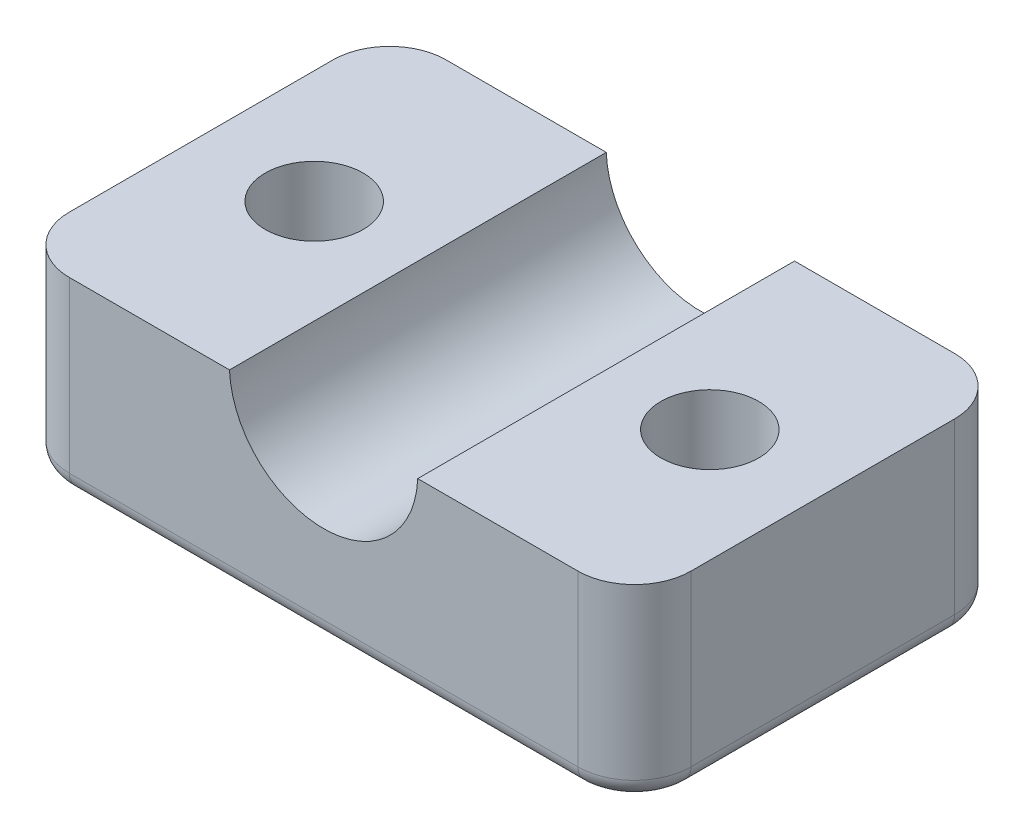
ISO-10303-21;
HEADER;
FILE_DESCRIPTION(('STEP AP214'),'2;1');
FILE_NAME('part.step','',(''),(''),'','','');
FILE_SCHEMA(('AUTOMOTIVE_DESIGN { 1 0 10303 214 1 1 1 1 }'));
ENDSEC;
DATA;
#1=APPLICATION_CONTEXT('core data for automotive mechanical design processes');
#2=APPLICATION_PROTOCOL_DEFINITION('international standard','automotive_design',2000,#1);
#3=PRODUCT_CONTEXT('',#1,'mechanical');
#4=PRODUCT('Part','Part','',(#3));
#5=PRODUCT_RELATED_PRODUCT_CATEGORY('part','',(#4));
#6=PRODUCT_DEFINITION_FORMATION('','',#4);
#7=PRODUCT_DEFINITION_CONTEXT('part definition',#1,'design');
#8=PRODUCT_DEFINITION('design','',#6,#7);
#9=PRODUCT_DEFINITION_SHAPE('','',#8);
#10=(LENGTH_UNIT() NAMED_UNIT(*) SI_UNIT(.MILLI.,.METRE.));
#11=(NAMED_UNIT(*) PLANE_ANGLE_UNIT() SI_UNIT($,.RADIAN.));
#12=(NAMED_UNIT(*) SI_UNIT($,.STERADIAN.) SOLID_ANGLE_UNIT());
#13=UNCERTAINTY_MEASURE_WITH_UNIT(LENGTH_MEASURE(1.E-05),#10,'distance_accuracy_value','');
#14=(GEOMETRIC_REPRESENTATION_CONTEXT(3) GLOBAL_UNCERTAINTY_ASSIGNED_CONTEXT((#13)) GLOBAL_UNIT_ASSIGNED_CONTEXT((#10,
#11,#12)) REPRESENTATION_CONTEXT('',''));
#15=CARTESIAN_POINT('',(0.,0.,0.));
#16=DIRECTION('',(0.,0.,1.));
#17=DIRECTION('',(1.,0.,0.));
#18=AXIS2_PLACEMENT_3D('',#15,#16,#17);
#19=CARTESIAN_POINT('',(-13.5,10.,7.));
#20=DIRECTION('',(0.,1.,0.));
#21=DIRECTION('',(0.,0.,1.));
#22=AXIS2_PLACEMENT_3D('',#19,#20,#21);
#23=PLANE('',#22);
#24=DIRECTION('',(0.,0.,-1.));
#25=VECTOR('',#24,1.);
#26=CARTESIAN_POINT('',(4.99599839871872,10.,24.142135623731));
#27=LINE('',#26,#25);
#28=CARTESIAN_POINT('',(4.99599839871872,10.,10.));
#29=VERTEX_POINT('',#28);
#30=CARTESIAN_POINT('',(4.99599839871872,10.,-10.));
#31=VERTEX_POINT('',#30);
#32=EDGE_CURVE('E145',#29,#31,#27,.T.);
#33=ORIENTED_EDGE('',*,*,#32,.F.);
#34=DIRECTION('',(1.,0.,0.));
#35=VECTOR('',#34,1.);
#36=CARTESIAN_POINT('',(-13.5,10.,10.));
#37=LINE('',#36,#35);
#38=CARTESIAN_POINT('',(13.5,10.,10.));
#39=VERTEX_POINT('',#38);
#40=EDGE_CURVE('E151',#29,#39,#37,.T.);
#41=ORIENTED_EDGE('',*,*,#40,.T.);
#42=CARTESIAN_POINT('',(13.5,10.,7.));
#43=DIRECTION('',(0.,1.,0.));
#44=DIRECTION('',(0.,0.,1.));
#45=AXIS2_PLACEMENT_3D('',#42,#43,#44);
#46=CIRCLE('',#45,3.);
#47=CARTESIAN_POINT('',(16.5,10.,7.));
#48=VERTEX_POINT('',#47);
#49=EDGE_CURVE('E158',#39,#48,#46,.T.);
#50=ORIENTED_EDGE('',*,*,#49,.T.);
#51=DIRECTION('',(0.,0.,-1.));
#52=VECTOR('',#51,1.);
#53=CARTESIAN_POINT('',(16.5,10.,7.));
#54=LINE('',#53,#52);
#55=CARTESIAN_POINT('',(16.5,10.,-7.));
#56=VERTEX_POINT('',#55);
#57=EDGE_CURVE('E160',#48,#56,#54,.T.);
#58=ORIENTED_EDGE('',*,*,#57,.T.);
#59=CARTESIAN_POINT('',(13.5,10.,-7.));
#60=DIRECTION('',(0.,1.,0.));
#61=DIRECTION('',(0.,0.,1.));
#62=AXIS2_PLACEMENT_3D('',#59,#60,#61);
#63=CIRCLE('',#62,3.);
#64=CARTESIAN_POINT('',(13.5,10.,-10.));
#65=VERTEX_POINT('',#64);
#66=EDGE_CURVE('E166',#56,#65,#63,.T.);
#67=ORIENTED_EDGE('',*,*,#66,.T.);
#68=DIRECTION('',(-1.,0.,0.));
#69=VECTOR('',#68,1.);
#70=CARTESIAN_POINT('',(-13.5,10.,-10.));
#71=LINE('',#70,#69);
#72=EDGE_CURVE('E169',#65,#31,#71,.T.);
#73=ORIENTED_EDGE('',*,*,#72,.T.);
#74=EDGE_LOOP('',(#33,#41,#50,#58,#67,#73));
#75=FACE_BOUND('',#74,.T.);
#76=CARTESIAN_POINT('',(10.5,10.,0.));
#77=DIRECTION('',(0.,1.,0.));
#78=DIRECTION('',(0.,0.,1.));
#79=AXIS2_PLACEMENT_3D('',#76,#77,#78);
#80=CIRCLE('',#79,2.6);
#81=CARTESIAN_POINT('',(10.5,10.,2.6));
#82=VERTEX_POINT('',#81);
#83=EDGE_CURVE('E264',#82,#82,#80,.T.);
#84=ORIENTED_EDGE('',*,*,#83,.F.);
#85=EDGE_LOOP('',(#84));
#86=FACE_BOUND('',#85,.T.);
#87=ADVANCED_FACE('F33',(#75,#86),#23,.T.);
#88=DIRECTION('',(0.,0.,-1.));
#89=VECTOR('',#88,1.);
#90=CARTESIAN_POINT('',(-4.99599839871872,10.,24.142135623731));
#91=LINE('',#90,#89);
#92=CARTESIAN_POINT('',(-4.99599839871872,10.,-10.));
#93=VERTEX_POINT('',#92);
#94=CARTESIAN_POINT('',(-4.99599839871872,10.,10.));
#95=VERTEX_POINT('',#94);
#96=EDGE_CURVE('E135',#93,#95,#91,.F.);
#97=ORIENTED_EDGE('',*,*,#96,.F.);
#98=CARTESIAN_POINT('',(-13.5,10.,-10.));
#99=VERTEX_POINT('',#98);
#100=EDGE_CURVE('E168',#93,#99,#71,.T.);
#101=ORIENTED_EDGE('',*,*,#100,.T.);
#102=CARTESIAN_POINT('',(-13.5,10.,-7.));
#103=DIRECTION('',(0.,1.,0.));
#104=DIRECTION('',(0.,0.,1.));
#105=AXIS2_PLACEMENT_3D('',#102,#103,#104);
#106=CIRCLE('',#105,3.);
#107=CARTESIAN_POINT('',(-16.5,10.,-7.));
#108=VERTEX_POINT('',#107);
#109=EDGE_CURVE('E172',#99,#108,#106,.T.);
#110=ORIENTED_EDGE('',*,*,#109,.T.);
#111=DIRECTION('',(0.,0.,1.));
#112=VECTOR('',#111,1.);
#113=CARTESIAN_POINT('',(-16.5,10.,7.));
#114=LINE('',#113,#112);
#115=CARTESIAN_POINT('',(-16.5,10.,7.));
#116=VERTEX_POINT('',#115);
#117=EDGE_CURVE('E174',#108,#116,#114,.T.);
#118=ORIENTED_EDGE('',*,*,#117,.T.);
#119=CARTESIAN_POINT('',(-13.5,10.,7.));
#120=DIRECTION('',(0.,1.,0.));
#121=DIRECTION('',(0.,0.,1.));
#122=AXIS2_PLACEMENT_3D('',#119,#120,#121);
#123=CIRCLE('',#122,3.);
#124=CARTESIAN_POINT('',(-13.5,10.,10.));
#125=VERTEX_POINT('',#124);
#126=EDGE_CURVE('E156',#116,#125,#123,.T.);
#127=ORIENTED_EDGE('',*,*,#126,.T.);
#128=EDGE_CURVE('E149',#125,#95,#37,.T.);
#129=ORIENTED_EDGE('',*,*,#128,.T.);
#130=EDGE_LOOP('',(#97,#101,#110,#118,#127,#129));
#131=FACE_BOUND('',#130,.T.);
#132=CARTESIAN_POINT('',(-10.5,10.,0.));
#133=DIRECTION('',(0.,1.,0.));
#134=DIRECTION('',(0.,0.,-1.));
#135=AXIS2_PLACEMENT_3D('',#132,#133,#134);
#136=CIRCLE('',#135,2.6);
#137=CARTESIAN_POINT('',(-10.5,10.,-2.6));
#138=VERTEX_POINT('',#137);
#139=EDGE_CURVE('E258',#138,#138,#136,.T.);
#140=ORIENTED_EDGE('',*,*,#139,.F.);
#141=EDGE_LOOP('',(#140));
#142=FACE_BOUND('',#141,.T.);
#143=ADVANCED_FACE('F153',(#131,#142),#23,.T.);
#144=CARTESIAN_POINT('',(-13.5,0.,7.));
#145=DIRECTION('',(0.,1.,0.));
#146=DIRECTION('',(0.,0.,1.));
#147=AXIS2_PLACEMENT_3D('',#144,#145,#146);
#148=PLANE('',#147);
#149=DIRECTION('',(1.,0.,0.));
#150=VECTOR('',#149,1.);
#151=CARTESIAN_POINT('',(-13.5,0.,9.));
#152=LINE('',#151,#150);
#153=CARTESIAN_POINT('',(13.5,0.,9.));
#154=VERTEX_POINT('',#153);
#155=CARTESIAN_POINT('',(-13.5,0.,9.));
#156=VERTEX_POINT('',#155);
#157=EDGE_CURVE('E200',#154,#156,#152,.F.);
#158=ORIENTED_EDGE('',*,*,#157,.T.);
#159=CARTESIAN_POINT('',(-13.5,0.,7.));
#160=DIRECTION('',(0.,1.,0.));
#161=DIRECTION('',(0.,0.,1.));
#162=AXIS2_PLACEMENT_3D('',#159,#160,#161);
#163=CIRCLE('',#162,2.);
#164=CARTESIAN_POINT('',(-15.5,0.,7.));
#165=VERTEX_POINT('',#164);
#166=EDGE_CURVE('E214',#156,#165,#163,.F.);
#167=ORIENTED_EDGE('',*,*,#166,.T.);
#168=DIRECTION('',(0.,0.,1.));
#169=VECTOR('',#168,1.);
#170=CARTESIAN_POINT('',(-15.5,0.,7.));
#171=LINE('',#170,#169);
#172=CARTESIAN_POINT('',(-15.5,0.,-7.));
#173=VERTEX_POINT('',#172);
#174=EDGE_CURVE('E212',#165,#173,#171,.F.);
#175=ORIENTED_EDGE('',*,*,#174,.T.);
#176=CARTESIAN_POINT('',(-13.5,0.,-7.));
#177=DIRECTION('',(0.,1.,0.));
#178=DIRECTION('',(0.,0.,1.));
#179=AXIS2_PLACEMENT_3D('',#176,#177,#178);
#180=CIRCLE('',#179,2.);
#181=CARTESIAN_POINT('',(-13.5,0.,-9.));
#182=VERTEX_POINT('',#181);
#183=EDGE_CURVE('E210',#173,#182,#180,.F.);
#184=ORIENTED_EDGE('',*,*,#183,.T.);
#185=DIRECTION('',(-1.,0.,0.));
#186=VECTOR('',#185,1.);
#187=CARTESIAN_POINT('',(-13.5,0.,-9.));
#188=LINE('',#187,#186);
#189=CARTESIAN_POINT('',(13.5,0.,-9.));
#190=VERTEX_POINT('',#189);
#191=EDGE_CURVE('E208',#182,#190,#188,.F.);
#192=ORIENTED_EDGE('',*,*,#191,.T.);
#193=CARTESIAN_POINT('',(13.5,0.,-7.));
#194=DIRECTION('',(0.,1.,0.));
#195=DIRECTION('',(0.,0.,1.));
#196=AXIS2_PLACEMENT_3D('',#193,#194,#195);
#197=CIRCLE('',#196,2.);
#198=CARTESIAN_POINT('',(15.5,0.,-7.));
#199=VERTEX_POINT('',#198);
#200=EDGE_CURVE('E206',#190,#199,#197,.F.);
#201=ORIENTED_EDGE('',*,*,#200,.T.);
#202=DIRECTION('',(0.,0.,-1.));
#203=VECTOR('',#202,1.);
#204=CARTESIAN_POINT('',(15.5,0.,7.));
#205=LINE('',#204,#203);
#206=CARTESIAN_POINT('',(15.5,0.,7.));
#207=VERTEX_POINT('',#206);
#208=EDGE_CURVE('E204',#199,#207,#205,.F.);
#209=ORIENTED_EDGE('',*,*,#208,.T.);
#210=CARTESIAN_POINT('',(13.5,0.,7.));
#211=DIRECTION('',(0.,1.,0.));
#212=DIRECTION('',(0.,0.,1.));
#213=AXIS2_PLACEMENT_3D('',#210,#211,#212);
#214=CIRCLE('',#213,2.);
#215=EDGE_CURVE('E202',#207,#154,#214,.F.);
#216=ORIENTED_EDGE('',*,*,#215,.T.);
#217=EDGE_LOOP('',(#158,#167,#175,#184,#192,#201,#209,#216));
#218=FACE_BOUND('',#217,.T.);
#219=CARTESIAN_POINT('',(10.5,0.,0.));
#220=DIRECTION('',(0.,1.,0.));
#221=DIRECTION('',(0.,0.,1.));
#222=AXIS2_PLACEMENT_3D('',#219,#220,#221);
#223=CIRCLE('',#222,2.6);
#224=CARTESIAN_POINT('',(10.5,0.,2.6));
#225=VERTEX_POINT('',#224);
#226=EDGE_CURVE('E261',#225,#225,#223,.T.);
#227=ORIENTED_EDGE('',*,*,#226,.T.);
#228=EDGE_LOOP('',(#227));
#229=FACE_BOUND('',#228,.T.);
#230=CARTESIAN_POINT('',(-10.5,0.,0.));
#231=DIRECTION('',(0.,1.,0.));
#232=DIRECTION('',(0.,0.,-1.));
#233=AXIS2_PLACEMENT_3D('',#230,#231,#232);
#234=CIRCLE('',#233,2.6);
#235=CARTESIAN_POINT('',(-10.5,0.,-2.6));
#236=VERTEX_POINT('',#235);
#237=EDGE_CURVE('E257',#236,#236,#234,.T.);
#238=ORIENTED_EDGE('',*,*,#237,.T.);
#239=EDGE_LOOP('',(#238));
#240=FACE_BOUND('',#239,.T.);
#241=ADVANCED_FACE('F269',(#218,#229,#240),#148,.F.);
#242=CARTESIAN_POINT('',(-13.5,10.,7.));
#243=DIRECTION('',(0.,-1.,0.));
#244=DIRECTION('',(0.,0.,-1.));
#245=AXIS2_PLACEMENT_3D('',#242,#243,#244);
#246=CYLINDRICAL_SURFACE('',#245,3.);
#247=DIRECTION('',(0.,-1.,0.));
#248=VECTOR('',#247,1.);
#249=CARTESIAN_POINT('',(-16.5,10.,7.));
#250=LINE('',#249,#248);
#251=CARTESIAN_POINT('',(-16.5,0.999999999999999,7.));
#252=VERTEX_POINT('',#251);
#253=EDGE_CURVE('E176',#116,#252,#250,.T.);
#254=ORIENTED_EDGE('',*,*,#253,.T.);
#255=CARTESIAN_POINT('',(-13.5,0.999999999999999,7.));
#256=DIRECTION('',(0.,1.,0.));
#257=DIRECTION('',(0.,0.,1.));
#258=AXIS2_PLACEMENT_3D('',#255,#256,#257);
#259=CIRCLE('',#258,3.);
#260=CARTESIAN_POINT('',(-13.5,0.999999999999999,10.));
#261=VERTEX_POINT('',#260);
#262=EDGE_CURVE('E197',#252,#261,#259,.T.);
#263=ORIENTED_EDGE('',*,*,#262,.T.);
#264=DIRECTION('',(0.,-1.,0.));
#265=VECTOR('',#264,1.);
#266=CARTESIAN_POINT('',(-13.5,10.,10.));
#267=LINE('',#266,#265);
#268=EDGE_CURVE('E195',#125,#261,#267,.T.);
#269=ORIENTED_EDGE('',*,*,#268,.F.);
#270=ORIENTED_EDGE('',*,*,#126,.F.);
#271=EDGE_LOOP('',(#254,#263,#269,#270));
#272=FACE_BOUND('',#271,.T.);
#273=ADVANCED_FACE('F296',(#272),#246,.T.);
#274=CARTESIAN_POINT('',(-13.5,10.,10.));
#275=DIRECTION('',(0.,0.,-1.));
#276=DIRECTION('',(-1.,0.,0.));
#277=AXIS2_PLACEMENT_3D('',#274,#275,#276);
#278=PLANE('',#277);
#279=ORIENTED_EDGE('',*,*,#268,.T.);
#280=DIRECTION('',(1.,0.,0.));
#281=VECTOR('',#280,1.);
#282=CARTESIAN_POINT('',(-13.5,0.999999999999999,10.));
#283=LINE('',#282,#281);
#284=CARTESIAN_POINT('',(13.5,0.999999999999999,10.));
#285=VERTEX_POINT('',#284);
#286=EDGE_CURVE('E11',#261,#285,#283,.T.);
#287=ORIENTED_EDGE('',*,*,#286,.T.);
#288=DIRECTION('',(0.,-1.,0.));
#289=VECTOR('',#288,1.);
#290=CARTESIAN_POINT('',(13.5,10.,10.));
#291=LINE('',#290,#289);
#292=EDGE_CURVE('E193',#39,#285,#291,.T.);
#293=ORIENTED_EDGE('',*,*,#292,.F.);
#294=ORIENTED_EDGE('',*,*,#40,.F.);
#295=CARTESIAN_POINT('',(0.,10.2,10.));
#296=DIRECTION('',(0.,0.,-1.));
#297=DIRECTION('',(-1.,0.,0.));
#298=AXIS2_PLACEMENT_3D('',#295,#296,#297);
#299=CIRCLE('',#298,5.);
#300=EDGE_CURVE('E138',#95,#29,#299,.F.);
#301=ORIENTED_EDGE('',*,*,#300,.F.);
#302=ORIENTED_EDGE('',*,*,#128,.F.);
#303=EDGE_LOOP('',(#279,#287,#293,#294,#301,#302));
#304=FACE_BOUND('',#303,.T.);
#305=ADVANCED_FACE('F148',(#304),#278,.F.);
#306=CARTESIAN_POINT('',(13.5,10.,7.));
#307=DIRECTION('',(0.,-1.,0.));
#308=DIRECTION('',(0.,0.,-1.));
#309=AXIS2_PLACEMENT_3D('',#306,#307,#308);
#310=CYLINDRICAL_SURFACE('',#309,3.);
#311=ORIENTED_EDGE('',*,*,#292,.T.);
#312=CARTESIAN_POINT('',(13.5,0.999999999999999,7.));
#313=DIRECTION('',(0.,1.,0.));
#314=DIRECTION('',(0.,0.,1.));
#315=AXIS2_PLACEMENT_3D('',#312,#313,#314);
#316=CIRCLE('',#315,3.);
#317=CARTESIAN_POINT('',(16.5,0.999999999999999,7.));
#318=VERTEX_POINT('',#317);
#319=EDGE_CURVE('E42',#285,#318,#316,.T.);
#320=ORIENTED_EDGE('',*,*,#319,.T.);
#321=DIRECTION('',(0.,-1.,0.));
#322=VECTOR('',#321,1.);
#323=CARTESIAN_POINT('',(16.5,10.,7.));
#324=LINE('',#323,#322);
#325=EDGE_CURVE('E191',#48,#318,#324,.T.);
#326=ORIENTED_EDGE('',*,*,#325,.F.);
#327=ORIENTED_EDGE('',*,*,#49,.F.);
#328=EDGE_LOOP('',(#311,#320,#326,#327));
#329=FACE_BOUND('',#328,.T.);
#330=ADVANCED_FACE('F313',(#329),#310,.T.);
#331=CARTESIAN_POINT('',(16.5,10.,7.));
#332=DIRECTION('',(-1.,0.,0.));
#333=DIRECTION('',(0.,0.,1.));
#334=AXIS2_PLACEMENT_3D('',#331,#332,#333);
#335=PLANE('',#334);
#336=ORIENTED_EDGE('',*,*,#325,.T.);
#337=DIRECTION('',(0.,0.,-1.));
#338=VECTOR('',#337,1.);
#339=CARTESIAN_POINT('',(16.5,0.999999999999999,7.));
#340=LINE('',#339,#338);
#341=CARTESIAN_POINT('',(16.5,0.999999999999999,-7.));
#342=VERTEX_POINT('',#341);
#343=EDGE_CURVE('E225',#318,#342,#340,.T.);
#344=ORIENTED_EDGE('',*,*,#343,.T.);
#345=DIRECTION('',(0.,-1.,0.));
#346=VECTOR('',#345,1.);
#347=CARTESIAN_POINT('',(16.5,10.,-7.));
#348=LINE('',#347,#346);
#349=EDGE_CURVE('E188',#56,#342,#348,.T.);
#350=ORIENTED_EDGE('',*,*,#349,.F.);
#351=ORIENTED_EDGE('',*,*,#57,.F.);
#352=EDGE_LOOP('',(#336,#344,#350,#351));
#353=FACE_BOUND('',#352,.T.);
#354=ADVANCED_FACE('F309',(#353),#335,.F.);
#355=CARTESIAN_POINT('',(13.5,10.,-7.));
#356=DIRECTION('',(0.,-1.,0.));
#357=DIRECTION('',(0.,0.,-1.));
#358=AXIS2_PLACEMENT_3D('',#355,#356,#357);
#359=CYLINDRICAL_SURFACE('',#358,3.);
#360=ORIENTED_EDGE('',*,*,#349,.T.);
#361=CARTESIAN_POINT('',(13.5,0.999999999999999,-7.));
#362=DIRECTION('',(0.,1.,0.));
#363=DIRECTION('',(0.,0.,1.));
#364=AXIS2_PLACEMENT_3D('',#361,#362,#363);
#365=CIRCLE('',#364,3.);
#366=CARTESIAN_POINT('',(13.5,0.999999999999999,-10.));
#367=VERTEX_POINT('',#366);
#368=EDGE_CURVE('E223',#342,#367,#365,.T.);
#369=ORIENTED_EDGE('',*,*,#368,.T.);
#370=DIRECTION('',(0.,-1.,0.));
#371=VECTOR('',#370,1.);
#372=CARTESIAN_POINT('',(13.5,10.,-10.));
#373=LINE('',#372,#371);
#374=EDGE_CURVE('E185',#65,#367,#373,.T.);
#375=ORIENTED_EDGE('',*,*,#374,.F.);
#376=ORIENTED_EDGE('',*,*,#66,.F.);
#377=EDGE_LOOP('',(#360,#369,#375,#376));
#378=FACE_BOUND('',#377,.T.);
#379=ADVANCED_FACE('F305',(#378),#359,.T.);
#380=CARTESIAN_POINT('',(-13.5,10.,-10.));
#381=DIRECTION('',(0.,0.,1.));
#382=DIRECTION('',(1.,0.,0.));
#383=AXIS2_PLACEMENT_3D('',#380,#381,#382);
#384=PLANE('',#383);
#385=ORIENTED_EDGE('',*,*,#374,.T.);
#386=DIRECTION('',(-1.,0.,0.));
#387=VECTOR('',#386,1.);
#388=CARTESIAN_POINT('',(-13.5,0.999999999999999,-10.));
#389=LINE('',#388,#387);
#390=CARTESIAN_POINT('',(-13.5,0.999999999999999,-10.));
#391=VERTEX_POINT('',#390);
#392=EDGE_CURVE('E221',#367,#391,#389,.T.);
#393=ORIENTED_EDGE('',*,*,#392,.T.);
#394=DIRECTION('',(0.,-1.,0.));
#395=VECTOR('',#394,1.);
#396=CARTESIAN_POINT('',(-13.5,10.,-10.));
#397=LINE('',#396,#395);
#398=EDGE_CURVE('E182',#99,#391,#397,.T.);
#399=ORIENTED_EDGE('',*,*,#398,.F.);
#400=ORIENTED_EDGE('',*,*,#100,.F.);
#401=CARTESIAN_POINT('',(0.,10.2,-10.));
#402=DIRECTION('',(0.,0.,-1.));
#403=DIRECTION('',(-1.,0.,0.));
#404=AXIS2_PLACEMENT_3D('',#401,#402,#403);
#405=CIRCLE('',#404,5.);
#406=EDGE_CURVE('E141',#31,#93,#405,.T.);
#407=ORIENTED_EDGE('',*,*,#406,.F.);
#408=ORIENTED_EDGE('',*,*,#72,.F.);
#409=EDGE_LOOP('',(#385,#393,#399,#400,#407,#408));
#410=FACE_BOUND('',#409,.T.);
#411=ADVANCED_FACE('F301',(#410),#384,.F.);
#412=CARTESIAN_POINT('',(-13.5,10.,-7.));
#413=DIRECTION('',(0.,-1.,0.));
#414=DIRECTION('',(0.,0.,-1.));
#415=AXIS2_PLACEMENT_3D('',#412,#413,#414);
#416=CYLINDRICAL_SURFACE('',#415,3.);
#417=ORIENTED_EDGE('',*,*,#398,.T.);
#418=CARTESIAN_POINT('',(-13.5,0.999999999999999,-7.));
#419=DIRECTION('',(0.,1.,0.));
#420=DIRECTION('',(0.,0.,1.));
#421=AXIS2_PLACEMENT_3D('',#418,#419,#420);
#422=CIRCLE('',#421,3.);
#423=CARTESIAN_POINT('',(-16.5,0.999999999999999,-7.));
#424=VERTEX_POINT('',#423);
#425=EDGE_CURVE('E219',#391,#424,#422,.T.);
#426=ORIENTED_EDGE('',*,*,#425,.T.);
#427=DIRECTION('',(0.,-1.,0.));
#428=VECTOR('',#427,1.);
#429=CARTESIAN_POINT('',(-16.5,10.,-7.));
#430=LINE('',#429,#428);
#431=EDGE_CURVE('E179',#108,#424,#430,.T.);
#432=ORIENTED_EDGE('',*,*,#431,.F.);
#433=ORIENTED_EDGE('',*,*,#109,.F.);
#434=EDGE_LOOP('',(#417,#426,#432,#433));
#435=FACE_BOUND('',#434,.T.);
#436=ADVANCED_FACE('F284',(#435),#416,.T.);
#437=CARTESIAN_POINT('',(-16.5,10.,7.));
#438=DIRECTION('',(1.,0.,0.));
#439=DIRECTION('',(0.,0.,-1.));
#440=AXIS2_PLACEMENT_3D('',#437,#438,#439);
#441=PLANE('',#440);
#442=ORIENTED_EDGE('',*,*,#431,.T.);
#443=DIRECTION('',(0.,0.,1.));
#444=VECTOR('',#443,1.);
#445=CARTESIAN_POINT('',(-16.5,0.999999999999999,7.));
#446=LINE('',#445,#444);
#447=EDGE_CURVE('E217',#424,#252,#446,.T.);
#448=ORIENTED_EDGE('',*,*,#447,.T.);
#449=ORIENTED_EDGE('',*,*,#253,.F.);
#450=ORIENTED_EDGE('',*,*,#117,.F.);
#451=EDGE_LOOP('',(#442,#448,#449,#450));
#452=FACE_BOUND('',#451,.T.);
#453=ADVANCED_FACE('F275',(#452),#441,.F.);
#454=CARTESIAN_POINT('',(10.5,10.,0.));
#455=DIRECTION('',(0.,-1.,0.));
#456=DIRECTION('',(0.,0.,-1.));
#457=AXIS2_PLACEMENT_3D('',#454,#455,#456);
#458=CYLINDRICAL_SURFACE('',#457,2.6);
#459=ORIENTED_EDGE('',*,*,#83,.T.);
#460=EDGE_LOOP('',(#459));
#461=FACE_BOUND('',#460,.T.);
#462=ORIENTED_EDGE('',*,*,#226,.F.);
#463=EDGE_LOOP('',(#462));
#464=FACE_BOUND('',#463,.T.);
#465=ADVANCED_FACE('F272',(#461,#464),#458,.F.);
#466=CARTESIAN_POINT('',(-10.5,10.,0.));
#467=DIRECTION('',(0.,-1.,0.));
#468=DIRECTION('',(0.,0.,-1.));
#469=AXIS2_PLACEMENT_3D('',#466,#467,#468);
#470=CYLINDRICAL_SURFACE('',#469,2.6);
#471=ORIENTED_EDGE('',*,*,#139,.T.);
#472=EDGE_LOOP('',(#471));
#473=FACE_BOUND('',#472,.T.);
#474=ORIENTED_EDGE('',*,*,#237,.F.);
#475=EDGE_LOOP('',(#474));
#476=FACE_BOUND('',#475,.T.);
#477=ADVANCED_FACE('F274',(#473,#476),#470,.F.);
#478=CARTESIAN_POINT('',(0.,10.2,24.142135623731));
#479=DIRECTION('',(0.,0.,-1.));
#480=DIRECTION('',(-1.,0.,0.));
#481=AXIS2_PLACEMENT_3D('',#478,#479,#480);
#482=CYLINDRICAL_SURFACE('',#481,5.);
#483=ORIENTED_EDGE('',*,*,#32,.T.);
#484=ORIENTED_EDGE('',*,*,#406,.T.);
#485=ORIENTED_EDGE('',*,*,#96,.T.);
#486=ORIENTED_EDGE('',*,*,#300,.T.);
#487=EDGE_LOOP('',(#483,#484,#485,#486));
#488=FACE_BOUND('',#487,.T.);
#489=ADVANCED_FACE('F137',(#488),#482,.F.);
#490=CARTESIAN_POINT('',(13.5,0.999999999999999,-7.));
#491=DIRECTION('',(0.,1.,0.));
#492=DIRECTION('',(0.,0.,1.));
#493=AXIS2_PLACEMENT_3D('',#490,#491,#492);
#494=TOROIDAL_SURFACE('',#493,2.,1.);
#495=CARTESIAN_POINT('',(15.5,1.,-7.));
#496=DIRECTION('',(0.,0.,1.));
#497=DIRECTION('',(1.,0.,0.));
#498=AXIS2_PLACEMENT_3D('',#495,#496,#497);
#499=CIRCLE('',#498,1.);
#500=EDGE_CURVE('E243',#199,#342,#499,.T.);
#501=ORIENTED_EDGE('',*,*,#500,.F.);
#502=ORIENTED_EDGE('',*,*,#200,.F.);
#503=CARTESIAN_POINT('',(13.5,0.999999999999999,-9.));
#504=DIRECTION('',(-1.,0.,0.));
#505=DIRECTION('',(0.,0.,1.));
#506=AXIS2_PLACEMENT_3D('',#503,#504,#505);
#507=CIRCLE('',#506,1.);
#508=EDGE_CURVE('E37',#367,#190,#507,.T.);
#509=ORIENTED_EDGE('',*,*,#508,.F.);
#510=ORIENTED_EDGE('',*,*,#368,.F.);
#511=EDGE_LOOP('',(#501,#502,#509,#510));
#512=FACE_BOUND('',#511,.T.);
#513=ADVANCED_FACE('F35',(#512),#494,.T.);
#514=CARTESIAN_POINT('',(-13.5,0.999999999999999,-9.));
#515=DIRECTION('',(-1.,0.,0.));
#516=DIRECTION('',(0.,0.,1.));
#517=AXIS2_PLACEMENT_3D('',#514,#515,#516);
#518=CYLINDRICAL_SURFACE('',#517,1.);
#519=ORIENTED_EDGE('',*,*,#508,.T.);
#520=ORIENTED_EDGE('',*,*,#191,.F.);
#521=CARTESIAN_POINT('',(-13.5,0.999999999999999,-9.));
#522=DIRECTION('',(-1.,0.,0.));
#523=DIRECTION('',(0.,0.,1.));
#524=AXIS2_PLACEMENT_3D('',#521,#522,#523);
#525=CIRCLE('',#524,1.);
#526=EDGE_CURVE('E241',#391,#182,#525,.T.);
#527=ORIENTED_EDGE('',*,*,#526,.F.);
#528=ORIENTED_EDGE('',*,*,#392,.F.);
#529=EDGE_LOOP('',(#519,#520,#527,#528));
#530=FACE_BOUND('',#529,.T.);
#531=ADVANCED_FACE('F344',(#530),#518,.T.);
#532=CARTESIAN_POINT('',(15.5,0.999999999999999,7.));
#533=DIRECTION('',(0.,0.,-1.));
#534=DIRECTION('',(-1.,0.,0.));
#535=AXIS2_PLACEMENT_3D('',#532,#533,#534);
#536=CYLINDRICAL_SURFACE('',#535,1.);
#537=ORIENTED_EDGE('',*,*,#500,.T.);
#538=ORIENTED_EDGE('',*,*,#343,.F.);
#539=CARTESIAN_POINT('',(15.5,1.,7.));
#540=DIRECTION('',(0.,0.,1.));
#541=DIRECTION('',(1.,0.,0.));
#542=AXIS2_PLACEMENT_3D('',#539,#540,#541);
#543=CIRCLE('',#542,1.);
#544=EDGE_CURVE('E238',#207,#318,#543,.T.);
#545=ORIENTED_EDGE('',*,*,#544,.F.);
#546=ORIENTED_EDGE('',*,*,#208,.F.);
#547=EDGE_LOOP('',(#537,#538,#545,#546));
#548=FACE_BOUND('',#547,.T.);
#549=ADVANCED_FACE('F341',(#548),#536,.T.);
#550=CARTESIAN_POINT('',(-13.5,0.999999999999999,-7.));
#551=DIRECTION('',(0.,1.,0.));
#552=DIRECTION('',(0.,0.,1.));
#553=AXIS2_PLACEMENT_3D('',#550,#551,#552);
#554=TOROIDAL_SURFACE('',#553,2.,1.);
#555=ORIENTED_EDGE('',*,*,#526,.T.);
#556=ORIENTED_EDGE('',*,*,#183,.F.);
#557=CARTESIAN_POINT('',(-15.5,0.999999999999999,-7.));
#558=DIRECTION('',(0.,0.,1.));
#559=DIRECTION('',(1.,0.,0.));
#560=AXIS2_PLACEMENT_3D('',#557,#558,#559);
#561=CIRCLE('',#560,1.);
#562=EDGE_CURVE('E235',#424,#173,#561,.T.);
#563=ORIENTED_EDGE('',*,*,#562,.F.);
#564=ORIENTED_EDGE('',*,*,#425,.F.);
#565=EDGE_LOOP('',(#555,#556,#563,#564));
#566=FACE_BOUND('',#565,.T.);
#567=ADVANCED_FACE('F337',(#566),#554,.T.);
#568=CARTESIAN_POINT('',(13.5,0.999999999999999,7.));
#569=DIRECTION('',(0.,1.,0.));
#570=DIRECTION('',(0.,0.,1.));
#571=AXIS2_PLACEMENT_3D('',#568,#569,#570);
#572=TOROIDAL_SURFACE('',#571,2.,1.);
#573=ORIENTED_EDGE('',*,*,#544,.T.);
#574=ORIENTED_EDGE('',*,*,#319,.F.);
#575=CARTESIAN_POINT('',(13.5,1.,9.));
#576=DIRECTION('',(-1.,0.,0.));
#577=DIRECTION('',(0.,0.,1.));
#578=AXIS2_PLACEMENT_3D('',#575,#576,#577);
#579=CIRCLE('',#578,1.);
#580=EDGE_CURVE('E232',#154,#285,#579,.T.);
#581=ORIENTED_EDGE('',*,*,#580,.F.);
#582=ORIENTED_EDGE('',*,*,#215,.F.);
#583=EDGE_LOOP('',(#573,#574,#581,#582));
#584=FACE_BOUND('',#583,.T.);
#585=ADVANCED_FACE('F333',(#584),#572,.T.);
#586=CARTESIAN_POINT('',(-15.5,0.999999999999999,7.));
#587=DIRECTION('',(0.,0.,1.));
#588=DIRECTION('',(1.,0.,0.));
#589=AXIS2_PLACEMENT_3D('',#586,#587,#588);
#590=CYLINDRICAL_SURFACE('',#589,1.);
#591=ORIENTED_EDGE('',*,*,#562,.T.);
#592=ORIENTED_EDGE('',*,*,#174,.F.);
#593=CARTESIAN_POINT('',(-15.5,0.999999999999999,7.));
#594=DIRECTION('',(0.,0.,1.));
#595=DIRECTION('',(1.,0.,0.));
#596=AXIS2_PLACEMENT_3D('',#593,#594,#595);
#597=CIRCLE('',#596,1.);
#598=EDGE_CURVE('E230',#252,#165,#597,.T.);
#599=ORIENTED_EDGE('',*,*,#598,.F.);
#600=ORIENTED_EDGE('',*,*,#447,.F.);
#601=EDGE_LOOP('',(#591,#592,#599,#600));
#602=FACE_BOUND('',#601,.T.);
#603=ADVANCED_FACE('F329',(#602),#590,.T.);
#604=CARTESIAN_POINT('',(-13.5,0.999999999999999,9.));
#605=DIRECTION('',(1.,0.,0.));
#606=DIRECTION('',(0.,0.,-1.));
#607=AXIS2_PLACEMENT_3D('',#604,#605,#606);
#608=CYLINDRICAL_SURFACE('',#607,1.);
#609=ORIENTED_EDGE('',*,*,#580,.T.);
#610=ORIENTED_EDGE('',*,*,#286,.F.);
#611=CARTESIAN_POINT('',(-13.5,1.,9.));
#612=DIRECTION('',(-1.,0.,0.));
#613=DIRECTION('',(0.,0.,1.));
#614=AXIS2_PLACEMENT_3D('',#611,#612,#613);
#615=CIRCLE('',#614,1.);
#616=EDGE_CURVE('E228',#156,#261,#615,.T.);
#617=ORIENTED_EDGE('',*,*,#616,.F.);
#618=ORIENTED_EDGE('',*,*,#157,.F.);
#619=EDGE_LOOP('',(#609,#610,#617,#618));
#620=FACE_BOUND('',#619,.T.);
#621=ADVANCED_FACE('F325',(#620),#608,.T.);
#622=CARTESIAN_POINT('',(-13.5,0.999999999999999,7.));
#623=DIRECTION('',(0.,1.,0.));
#624=DIRECTION('',(0.,0.,1.));
#625=AXIS2_PLACEMENT_3D('',#622,#623,#624);
#626=TOROIDAL_SURFACE('',#625,2.,1.);
#627=ORIENTED_EDGE('',*,*,#598,.T.);
#628=ORIENTED_EDGE('',*,*,#166,.F.);
#629=ORIENTED_EDGE('',*,*,#616,.T.);
#630=ORIENTED_EDGE('',*,*,#262,.F.);
#631=EDGE_LOOP('',(#627,#628,#629,#630));
#632=FACE_BOUND('',#631,.T.);
#633=ADVANCED_FACE('F322',(#632),#626,.T.);
#634=CLOSED_SHELL('',(#87,#143,#241,#273,#305,#330,#354,#379,#411,#436,#453,#465,#477,#489,#513,
#531,#549,#567,#585,#603,#621,#633));
#635=MANIFOLD_SOLID_BREP('B2',#634);
#636=ADVANCED_BREP_SHAPE_REPRESENTATION('',(#18,#635),#14);
#637=SHAPE_DEFINITION_REPRESENTATION(#9,#636);
ENDSEC;
END-ISO-10303-21;
